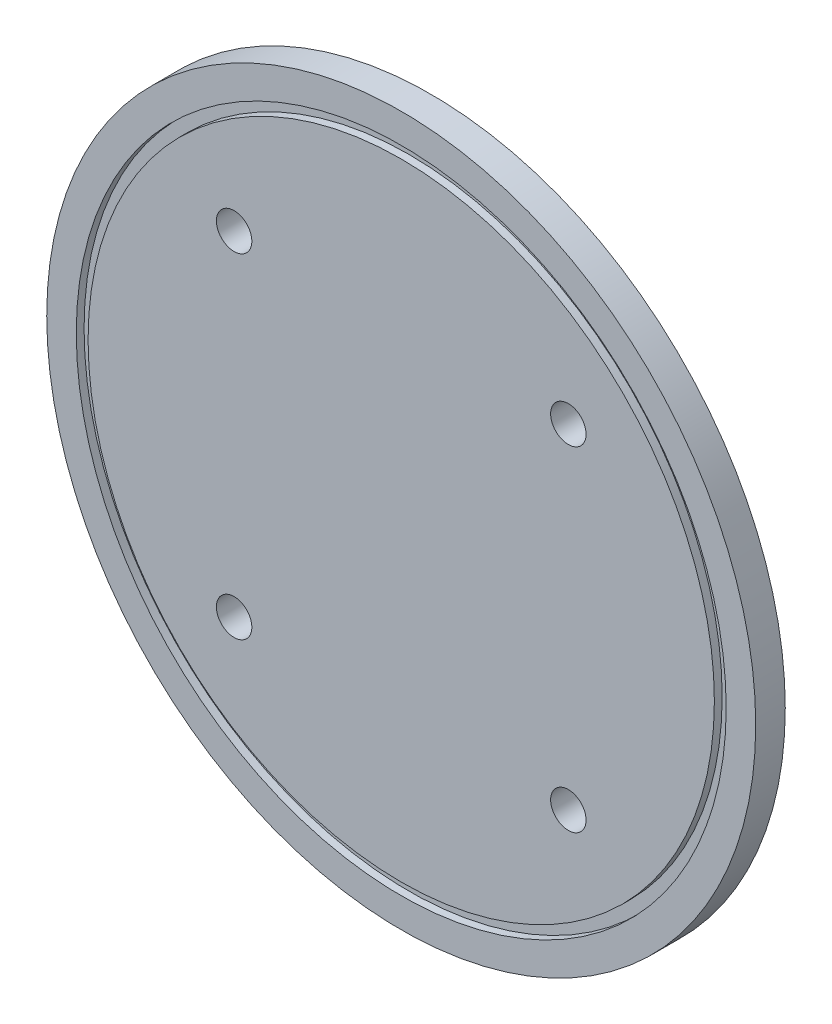
ISO-10303-21;
HEADER;
FILE_DESCRIPTION(('STEP AP214'),'2;1');
FILE_NAME('part.step','',(''),(''),'','','');
FILE_SCHEMA(('AUTOMOTIVE_DESIGN { 1 0 10303 214 1 1 1 1 }'));
ENDSEC;
DATA;
#1=APPLICATION_CONTEXT('core data for automotive mechanical design processes');
#2=APPLICATION_PROTOCOL_DEFINITION('international standard','automotive_design',2000,#1);
#3=PRODUCT_CONTEXT('',#1,'mechanical');
#4=PRODUCT('Part','Part','',(#3));
#5=PRODUCT_RELATED_PRODUCT_CATEGORY('part','',(#4));
#6=PRODUCT_DEFINITION_FORMATION('','',#4);
#7=PRODUCT_DEFINITION_CONTEXT('part definition',#1,'design');
#8=PRODUCT_DEFINITION('design','',#6,#7);
#9=PRODUCT_DEFINITION_SHAPE('','',#8);
#10=(LENGTH_UNIT() NAMED_UNIT(*) SI_UNIT(.MILLI.,.METRE.));
#11=(NAMED_UNIT(*) PLANE_ANGLE_UNIT() SI_UNIT($,.RADIAN.));
#12=(NAMED_UNIT(*) SI_UNIT($,.STERADIAN.) SOLID_ANGLE_UNIT());
#13=UNCERTAINTY_MEASURE_WITH_UNIT(LENGTH_MEASURE(1.E-05),#10,'distance_accuracy_value','');
#14=(GEOMETRIC_REPRESENTATION_CONTEXT(3) GLOBAL_UNCERTAINTY_ASSIGNED_CONTEXT((#13)) GLOBAL_UNIT_ASSIGNED_CONTEXT((#10,
#11,#12)) REPRESENTATION_CONTEXT('',''));
#15=CARTESIAN_POINT('',(0.,0.,0.));
#16=DIRECTION('',(0.,0.,1.));
#17=DIRECTION('',(1.,0.,0.));
#18=AXIS2_PLACEMENT_3D('',#15,#16,#17);
#19=CARTESIAN_POINT('',(0.,0.,5.));
#20=DIRECTION('',(0.,0.,1.));
#21=DIRECTION('',(1.,0.,0.));
#22=AXIS2_PLACEMENT_3D('',#19,#20,#21);
#23=PLANE('',#22);
#24=CARTESIAN_POINT('',(0.,0.,5.));
#25=DIRECTION('',(0.,0.,1.));
#26=DIRECTION('',(1.,0.,0.));
#27=AXIS2_PLACEMENT_3D('',#24,#25,#26);
#28=CIRCLE('',#27,55.);
#29=CARTESIAN_POINT('',(55.,0.,5.));
#30=VERTEX_POINT('',#29);
#31=EDGE_CURVE('E63',#30,#30,#28,.T.);
#32=ORIENTED_EDGE('',*,*,#31,.F.);
#33=EDGE_LOOP('',(#32));
#34=FACE_BOUND('',#33,.T.);
#35=CARTESIAN_POINT('',(0.,0.,5.));
#36=DIRECTION('',(0.,0.,1.));
#37=DIRECTION('',(1.,0.,0.));
#38=AXIS2_PLACEMENT_3D('',#35,#36,#37);
#39=CIRCLE('',#38,60.);
#40=CARTESIAN_POINT('',(60.,0.,5.));
#41=VERTEX_POINT('',#40);
#42=EDGE_CURVE('E75',#41,#41,#39,.T.);
#43=ORIENTED_EDGE('',*,*,#42,.T.);
#44=EDGE_LOOP('',(#43));
#45=FACE_BOUND('',#44,.T.);
#46=ADVANCED_FACE('F32',(#34,#45),#23,.T.);
#47=CARTESIAN_POINT('',(0.,0.,0.));
#48=DIRECTION('',(0.,0.,1.));
#49=DIRECTION('',(1.,0.,0.));
#50=AXIS2_PLACEMENT_3D('',#47,#48,#49);
#51=PLANE('',#50);
#52=CARTESIAN_POINT('',(28.2842712474618,28.284271247462,0.));
#53=DIRECTION('',(0.,0.,1.));
#54=DIRECTION('',(1.,0.,0.));
#55=AXIS2_PLACEMENT_3D('',#52,#53,#54);
#56=CIRCLE('',#55,3.);
#57=CARTESIAN_POINT('',(31.2842712474618,28.284271247462,0.));
#58=VERTEX_POINT('',#57);
#59=EDGE_CURVE('E10',#58,#58,#56,.T.);
#60=ORIENTED_EDGE('',*,*,#59,.T.);
#61=EDGE_LOOP('',(#60));
#62=FACE_BOUND('',#61,.T.);
#63=CARTESIAN_POINT('',(28.2842712474622,-28.2842712474616,0.));
#64=DIRECTION('',(0.,0.,1.));
#65=DIRECTION('',(0.,-1.,0.));
#66=AXIS2_PLACEMENT_3D('',#63,#64,#65);
#67=CIRCLE('',#66,3.);
#68=CARTESIAN_POINT('',(28.2842712474623,-31.2842712474615,0.));
#69=VERTEX_POINT('',#68);
#70=EDGE_CURVE('E48',#69,#69,#67,.T.);
#71=ORIENTED_EDGE('',*,*,#70,.T.);
#72=EDGE_LOOP('',(#71));
#73=FACE_BOUND('',#72,.T.);
#74=CARTESIAN_POINT('',(-28.2842712474618,-28.284271247462,0.));
#75=DIRECTION('',(0.,0.,1.));
#76=DIRECTION('',(-1.,0.,0.));
#77=AXIS2_PLACEMENT_3D('',#74,#75,#76);
#78=CIRCLE('',#77,3.);
#79=CARTESIAN_POINT('',(-31.2842712474618,-28.284271247462,0.));
#80=VERTEX_POINT('',#79);
#81=EDGE_CURVE('E55',#80,#80,#78,.T.);
#82=ORIENTED_EDGE('',*,*,#81,.T.);
#83=EDGE_LOOP('',(#82));
#84=FACE_BOUND('',#83,.T.);
#85=CARTESIAN_POINT('',(-28.2842712474621,28.2842712474617,0.));
#86=DIRECTION('',(0.,0.,1.));
#87=DIRECTION('',(0.,1.,0.));
#88=AXIS2_PLACEMENT_3D('',#85,#86,#87);
#89=CIRCLE('',#88,3.);
#90=CARTESIAN_POINT('',(-28.2842712474621,31.2842712474617,0.));
#91=VERTEX_POINT('',#90);
#92=EDGE_CURVE('E43',#91,#91,#89,.T.);
#93=ORIENTED_EDGE('',*,*,#92,.T.);
#94=EDGE_LOOP('',(#93));
#95=FACE_BOUND('',#94,.T.);
#96=CARTESIAN_POINT('',(0.,0.,0.));
#97=DIRECTION('',(0.,0.,1.));
#98=DIRECTION('',(1.,0.,0.));
#99=AXIS2_PLACEMENT_3D('',#96,#97,#98);
#100=CIRCLE('',#99,60.);
#101=CARTESIAN_POINT('',(60.,0.,0.));
#102=VERTEX_POINT('',#101);
#103=EDGE_CURVE('E72',#102,#102,#100,.T.);
#104=ORIENTED_EDGE('',*,*,#103,.F.);
#105=EDGE_LOOP('',(#104));
#106=FACE_BOUND('',#105,.T.);
#107=ADVANCED_FACE('F34',(#62,#73,#84,#95,#106),#51,.F.);
#108=CARTESIAN_POINT('',(28.2842712474618,28.284271247462,5.));
#109=DIRECTION('',(0.,0.,1.));
#110=DIRECTION('',(1.,0.,0.));
#111=AXIS2_PLACEMENT_3D('',#108,#109,#110);
#112=CIRCLE('',#111,3.);
#113=CARTESIAN_POINT('',(31.2842712474618,28.284271247462,5.));
#114=VERTEX_POINT('',#113);
#115=EDGE_CURVE('E36',#114,#114,#112,.T.);
#116=ORIENTED_EDGE('',*,*,#115,.F.);
#117=EDGE_LOOP('',(#116));
#118=FACE_BOUND('',#117,.T.);
#119=CARTESIAN_POINT('',(28.2842712474622,-28.2842712474616,5.));
#120=DIRECTION('',(0.,0.,1.));
#121=DIRECTION('',(0.,-1.,0.));
#122=AXIS2_PLACEMENT_3D('',#119,#120,#121);
#123=CIRCLE('',#122,3.);
#124=CARTESIAN_POINT('',(28.2842712474623,-31.2842712474615,5.));
#125=VERTEX_POINT('',#124);
#126=EDGE_CURVE('E45',#125,#125,#123,.T.);
#127=ORIENTED_EDGE('',*,*,#126,.F.);
#128=EDGE_LOOP('',(#127));
#129=FACE_BOUND('',#128,.T.);
#130=CARTESIAN_POINT('',(-28.2842712474618,-28.284271247462,5.));
#131=DIRECTION('',(0.,0.,1.));
#132=DIRECTION('',(-1.,0.,0.));
#133=AXIS2_PLACEMENT_3D('',#130,#131,#132);
#134=CIRCLE('',#133,3.);
#135=CARTESIAN_POINT('',(-31.2842712474618,-28.284271247462,5.));
#136=VERTEX_POINT('',#135);
#137=EDGE_CURVE('E52',#136,#136,#134,.T.);
#138=ORIENTED_EDGE('',*,*,#137,.F.);
#139=EDGE_LOOP('',(#138));
#140=FACE_BOUND('',#139,.T.);
#141=CARTESIAN_POINT('',(-28.2842712474621,28.2842712474617,5.));
#142=DIRECTION('',(0.,0.,1.));
#143=DIRECTION('',(0.,1.,0.));
#144=AXIS2_PLACEMENT_3D('',#141,#142,#143);
#145=CIRCLE('',#144,3.);
#146=CARTESIAN_POINT('',(-28.2842712474621,31.2842712474617,5.));
#147=VERTEX_POINT('',#146);
#148=EDGE_CURVE('E58',#147,#147,#145,.T.);
#149=ORIENTED_EDGE('',*,*,#148,.F.);
#150=EDGE_LOOP('',(#149));
#151=FACE_BOUND('',#150,.T.);
#152=CARTESIAN_POINT('',(0.,0.,5.));
#153=DIRECTION('',(0.,0.,1.));
#154=DIRECTION('',(1.,0.,0.));
#155=AXIS2_PLACEMENT_3D('',#152,#153,#154);
#156=CIRCLE('',#155,53.);
#157=CARTESIAN_POINT('',(53.,0.,5.));
#158=VERTEX_POINT('',#157);
#159=EDGE_CURVE('E69',#158,#158,#156,.T.);
#160=ORIENTED_EDGE('',*,*,#159,.T.);
#161=EDGE_LOOP('',(#160));
#162=FACE_BOUND('',#161,.T.);
#163=ADVANCED_FACE('F85',(#118,#129,#140,#151,#162),#23,.T.);
#164=CARTESIAN_POINT('',(28.2842712474618,28.284271247462,0.));
#165=DIRECTION('',(0.,0.,1.));
#166=DIRECTION('',(1.,0.,0.));
#167=AXIS2_PLACEMENT_3D('',#164,#165,#166);
#168=CYLINDRICAL_SURFACE('',#167,3.);
#169=ORIENTED_EDGE('',*,*,#59,.F.);
#170=EDGE_LOOP('',(#169));
#171=FACE_BOUND('',#170,.T.);
#172=ORIENTED_EDGE('',*,*,#115,.T.);
#173=EDGE_LOOP('',(#172));
#174=FACE_BOUND('',#173,.T.);
#175=ADVANCED_FACE('F90',(#171,#174),#168,.F.);
#176=CARTESIAN_POINT('',(28.2842712474622,-28.2842712474616,0.));
#177=DIRECTION('',(0.,0.,1.));
#178=DIRECTION('',(1.,0.,0.));
#179=AXIS2_PLACEMENT_3D('',#176,#177,#178);
#180=CYLINDRICAL_SURFACE('',#179,3.);
#181=ORIENTED_EDGE('',*,*,#70,.F.);
#182=EDGE_LOOP('',(#181));
#183=FACE_BOUND('',#182,.T.);
#184=ORIENTED_EDGE('',*,*,#126,.T.);
#185=EDGE_LOOP('',(#184));
#186=FACE_BOUND('',#185,.T.);
#187=ADVANCED_FACE('F129',(#183,#186),#180,.F.);
#188=CARTESIAN_POINT('',(-28.2842712474618,-28.284271247462,0.));
#189=DIRECTION('',(0.,0.,1.));
#190=DIRECTION('',(1.,0.,0.));
#191=AXIS2_PLACEMENT_3D('',#188,#189,#190);
#192=CYLINDRICAL_SURFACE('',#191,3.);
#193=ORIENTED_EDGE('',*,*,#81,.F.);
#194=EDGE_LOOP('',(#193));
#195=FACE_BOUND('',#194,.T.);
#196=ORIENTED_EDGE('',*,*,#137,.T.);
#197=EDGE_LOOP('',(#196));
#198=FACE_BOUND('',#197,.T.);
#199=ADVANCED_FACE('F104',(#195,#198),#192,.F.);
#200=CARTESIAN_POINT('',(-28.2842712474621,28.2842712474617,0.));
#201=DIRECTION('',(0.,0.,1.));
#202=DIRECTION('',(1.,0.,0.));
#203=AXIS2_PLACEMENT_3D('',#200,#201,#202);
#204=CYLINDRICAL_SURFACE('',#203,3.);
#205=ORIENTED_EDGE('',*,*,#92,.F.);
#206=EDGE_LOOP('',(#205));
#207=FACE_BOUND('',#206,.T.);
#208=ORIENTED_EDGE('',*,*,#148,.T.);
#209=EDGE_LOOP('',(#208));
#210=FACE_BOUND('',#209,.T.);
#211=ADVANCED_FACE('F100',(#207,#210),#204,.F.);
#212=CARTESIAN_POINT('',(0.,0.,3.6792));
#213=DIRECTION('',(0.,0.,1.));
#214=DIRECTION('',(1.,0.,0.));
#215=AXIS2_PLACEMENT_3D('',#212,#213,#214);
#216=CYLINDRICAL_SURFACE('',#215,55.);
#217=CARTESIAN_POINT('',(0.,0.,3.6792));
#218=DIRECTION('',(0.,0.,1.));
#219=DIRECTION('',(1.,0.,0.));
#220=AXIS2_PLACEMENT_3D('',#217,#218,#219);
#221=CIRCLE('',#220,55.);
#222=CARTESIAN_POINT('',(55.,0.,3.6792));
#223=VERTEX_POINT('',#222);
#224=EDGE_CURVE('E49',#223,#223,#221,.T.);
#225=ORIENTED_EDGE('',*,*,#224,.F.);
#226=EDGE_LOOP('',(#225));
#227=FACE_BOUND('',#226,.T.);
#228=ORIENTED_EDGE('',*,*,#31,.T.);
#229=EDGE_LOOP('',(#228));
#230=FACE_BOUND('',#229,.T.);
#231=ADVANCED_FACE('F103',(#227,#230),#216,.F.);
#232=CARTESIAN_POINT('',(0.,0.,3.6792));
#233=DIRECTION('',(0.,0.,1.));
#234=DIRECTION('',(1.,0.,0.));
#235=AXIS2_PLACEMENT_3D('',#232,#233,#234);
#236=PLANE('',#235);
#237=CARTESIAN_POINT('',(0.,0.,3.6792));
#238=DIRECTION('',(0.,0.,1.));
#239=DIRECTION('',(1.,0.,0.));
#240=AXIS2_PLACEMENT_3D('',#237,#238,#239);
#241=CIRCLE('',#240,53.);
#242=CARTESIAN_POINT('',(53.,0.,3.6792));
#243=VERTEX_POINT('',#242);
#244=EDGE_CURVE('E66',#243,#243,#241,.T.);
#245=ORIENTED_EDGE('',*,*,#244,.F.);
#246=EDGE_LOOP('',(#245));
#247=FACE_BOUND('',#246,.T.);
#248=ORIENTED_EDGE('',*,*,#224,.T.);
#249=EDGE_LOOP('',(#248));
#250=FACE_BOUND('',#249,.T.);
#251=ADVANCED_FACE('F113',(#247,#250),#236,.T.);
#252=CARTESIAN_POINT('',(0.,0.,3.6792));
#253=DIRECTION('',(0.,0.,1.));
#254=DIRECTION('',(1.,0.,0.));
#255=AXIS2_PLACEMENT_3D('',#252,#253,#254);
#256=CYLINDRICAL_SURFACE('',#255,53.);
#257=ORIENTED_EDGE('',*,*,#244,.T.);
#258=EDGE_LOOP('',(#257));
#259=FACE_BOUND('',#258,.T.);
#260=ORIENTED_EDGE('',*,*,#159,.F.);
#261=EDGE_LOOP('',(#260));
#262=FACE_BOUND('',#261,.T.);
#263=ADVANCED_FACE('F111',(#259,#262),#256,.T.);
#264=CARTESIAN_POINT('',(0.,0.,0.));
#265=DIRECTION('',(0.,0.,1.));
#266=DIRECTION('',(1.,0.,0.));
#267=AXIS2_PLACEMENT_3D('',#264,#265,#266);
#268=CYLINDRICAL_SURFACE('',#267,60.);
#269=ORIENTED_EDGE('',*,*,#103,.T.);
#270=EDGE_LOOP('',(#269));
#271=FACE_BOUND('',#270,.T.);
#272=ORIENTED_EDGE('',*,*,#42,.F.);
#273=EDGE_LOOP('',(#272));
#274=FACE_BOUND('',#273,.T.);
#275=ADVANCED_FACE('F81',(#271,#274),#268,.T.);
#276=CLOSED_SHELL('',(#46,#107,#163,#175,#187,#199,#211,#231,#251,#263,#275));
#277=MANIFOLD_SOLID_BREP('B2',#276);
#278=ADVANCED_BREP_SHAPE_REPRESENTATION('',(#18,#277),#14);
#279=SHAPE_DEFINITION_REPRESENTATION(#9,#278);
ENDSEC;
END-ISO-10303-21;
